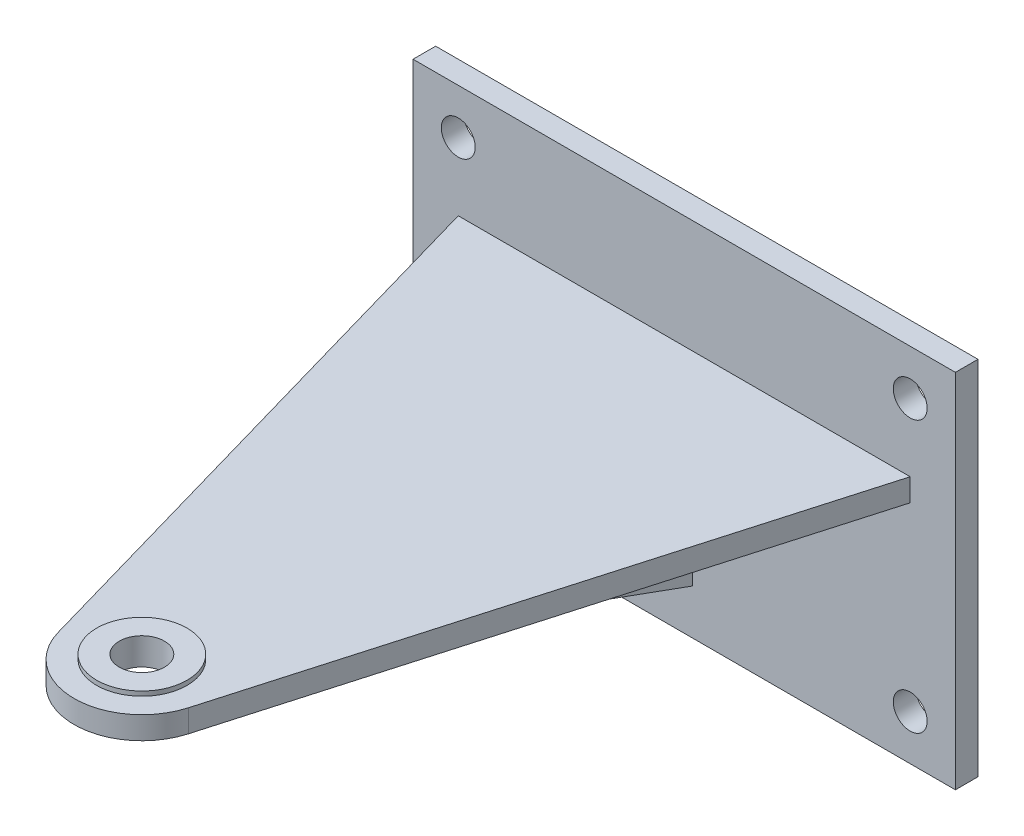
ISO-10303-21;
HEADER;
FILE_DESCRIPTION(('STEP AP214'),'2;1');
FILE_NAME('part.step','',(''),(''),'','','');
FILE_SCHEMA(('AUTOMOTIVE_DESIGN { 1 0 10303 214 1 1 1 1 }'));
ENDSEC;
DATA;
#1=APPLICATION_CONTEXT('core data for automotive mechanical design processes');
#2=APPLICATION_PROTOCOL_DEFINITION('international standard','automotive_design',2000,#1);
#3=PRODUCT_CONTEXT('',#1,'mechanical');
#4=PRODUCT('Part','Part','',(#3));
#5=PRODUCT_RELATED_PRODUCT_CATEGORY('part','',(#4));
#6=PRODUCT_DEFINITION_FORMATION('','',#4);
#7=PRODUCT_DEFINITION_CONTEXT('part definition',#1,'design');
#8=PRODUCT_DEFINITION('design','',#6,#7);
#9=PRODUCT_DEFINITION_SHAPE('','',#8);
#10=(LENGTH_UNIT() NAMED_UNIT(*) SI_UNIT(.MILLI.,.METRE.));
#11=(NAMED_UNIT(*) PLANE_ANGLE_UNIT() SI_UNIT($,.RADIAN.));
#12=(NAMED_UNIT(*) SI_UNIT($,.STERADIAN.) SOLID_ANGLE_UNIT());
#13=UNCERTAINTY_MEASURE_WITH_UNIT(LENGTH_MEASURE(1.E-05),#10,'distance_accuracy_value','');
#14=(GEOMETRIC_REPRESENTATION_CONTEXT(3) GLOBAL_UNCERTAINTY_ASSIGNED_CONTEXT((#13)) GLOBAL_UNIT_ASSIGNED_CONTEXT((#10,
#11,#12)) REPRESENTATION_CONTEXT('',''));
#15=CARTESIAN_POINT('',(0.,0.,0.));
#16=DIRECTION('',(0.,0.,1.));
#17=DIRECTION('',(1.,0.,0.));
#18=AXIS2_PLACEMENT_3D('',#15,#16,#17);
#19=CARTESIAN_POINT('',(0.,0.,6.35));
#20=DIRECTION('',(0.,0.,1.));
#21=DIRECTION('',(1.,0.,0.));
#22=AXIS2_PLACEMENT_3D('',#19,#20,#21);
#23=PLANE('',#22);
#24=CARTESIAN_POINT('',(-63.5,-38.1,6.35));
#25=DIRECTION('',(0.,0.,1.));
#26=DIRECTION('',(1.,0.,0.));
#27=AXIS2_PLACEMENT_3D('',#24,#25,#26);
#28=CIRCLE('',#27,4.7625);
#29=CARTESIAN_POINT('',(-58.7375,-38.1,6.35));
#30=VERTEX_POINT('',#29);
#31=EDGE_CURVE('E500',#30,#30,#28,.T.);
#32=ORIENTED_EDGE('',*,*,#31,.F.);
#33=EDGE_LOOP('',(#32));
#34=FACE_BOUND('',#33,.T.);
#35=CARTESIAN_POINT('',(63.5,38.1,6.35));
#36=DIRECTION('',(0.,0.,1.));
#37=DIRECTION('',(1.,0.,0.));
#38=AXIS2_PLACEMENT_3D('',#35,#36,#37);
#39=CIRCLE('',#38,4.7625);
#40=CARTESIAN_POINT('',(68.2625,38.1,6.35));
#41=VERTEX_POINT('',#40);
#42=EDGE_CURVE('E502',#41,#41,#39,.T.);
#43=ORIENTED_EDGE('',*,*,#42,.F.);
#44=EDGE_LOOP('',(#43));
#45=FACE_BOUND('',#44,.T.);
#46=CARTESIAN_POINT('',(63.5,-38.1,6.35));
#47=DIRECTION('',(0.,0.,1.));
#48=DIRECTION('',(1.,0.,0.));
#49=AXIS2_PLACEMENT_3D('',#46,#47,#48);
#50=CIRCLE('',#49,4.7625);
#51=CARTESIAN_POINT('',(68.2625,-38.1,6.35));
#52=VERTEX_POINT('',#51);
#53=EDGE_CURVE('E505',#52,#52,#50,.T.);
#54=ORIENTED_EDGE('',*,*,#53,.F.);
#55=EDGE_LOOP('',(#54));
#56=FACE_BOUND('',#55,.T.);
#57=CARTESIAN_POINT('',(-63.5,38.1,6.35));
#58=DIRECTION('',(0.,0.,1.));
#59=DIRECTION('',(1.,0.,0.));
#60=AXIS2_PLACEMENT_3D('',#57,#58,#59);
#61=CIRCLE('',#60,4.7625);
#62=CARTESIAN_POINT('',(-58.7375,38.1,6.35));
#63=VERTEX_POINT('',#62);
#64=EDGE_CURVE('E494',#63,#63,#61,.T.);
#65=ORIENTED_EDGE('',*,*,#64,.F.);
#66=EDGE_LOOP('',(#65));
#67=FACE_BOUND('',#66,.T.);
#68=DIRECTION('',(0.,1.,0.));
#69=VECTOR('',#68,1.);
#70=CARTESIAN_POINT('',(-63.5,12.7,6.35));
#71=LINE('',#70,#69);
#72=CARTESIAN_POINT('',(-63.5,12.7,6.35));
#73=VERTEX_POINT('',#72);
#74=CARTESIAN_POINT('',(-63.5,19.05,6.35));
#75=VERTEX_POINT('',#74);
#76=EDGE_CURVE('E239',#73,#75,#71,.T.);
#77=ORIENTED_EDGE('',*,*,#76,.T.);
#78=DIRECTION('',(-1.,0.,0.));
#79=VECTOR('',#78,1.);
#80=CARTESIAN_POINT('',(-63.5,19.05,6.35));
#81=LINE('',#80,#79);
#82=CARTESIAN_POINT('',(63.5,19.05,6.35));
#83=VERTEX_POINT('',#82);
#84=EDGE_CURVE('E223',#83,#75,#81,.T.);
#85=ORIENTED_EDGE('',*,*,#84,.F.);
#86=DIRECTION('',(0.,1.,0.));
#87=VECTOR('',#86,1.);
#88=CARTESIAN_POINT('',(63.5,12.7,6.34999999999998));
#89=LINE('',#88,#87);
#90=CARTESIAN_POINT('',(63.5,12.7,6.34999999999998));
#91=VERTEX_POINT('',#90);
#92=EDGE_CURVE('E249',#91,#83,#89,.T.);
#93=ORIENTED_EDGE('',*,*,#92,.F.);
#94=DIRECTION('',(-1.,0.,0.));
#95=VECTOR('',#94,1.);
#96=CARTESIAN_POINT('',(-63.5,12.7,6.35));
#97=LINE('',#96,#95);
#98=CARTESIAN_POINT('',(26.67,12.7,6.34999999999999));
#99=VERTEX_POINT('',#98);
#100=EDGE_CURVE('E224',#91,#99,#97,.T.);
#101=ORIENTED_EDGE('',*,*,#100,.T.);
#102=DIRECTION('',(0.,1.,0.));
#103=VECTOR('',#102,1.);
#104=CARTESIAN_POINT('',(26.67,0.,6.35));
#105=LINE('',#104,#103);
#106=CARTESIAN_POINT('',(26.67,-12.7,6.35));
#107=VERTEX_POINT('',#106);
#108=EDGE_CURVE('E191',#107,#99,#105,.T.);
#109=ORIENTED_EDGE('',*,*,#108,.F.);
#110=DIRECTION('',(1.,0.,0.));
#111=VECTOR('',#110,1.);
#112=CARTESIAN_POINT('',(0.,-12.7,6.35));
#113=LINE('',#112,#111);
#114=CARTESIAN_POINT('',(24.13,-12.7,6.35));
#115=VERTEX_POINT('',#114);
#116=EDGE_CURVE('E196',#115,#107,#113,.T.);
#117=ORIENTED_EDGE('',*,*,#116,.F.);
#118=DIRECTION('',(0.,1.,0.));
#119=VECTOR('',#118,1.);
#120=CARTESIAN_POINT('',(24.13,0.,6.35));
#121=LINE('',#120,#119);
#122=CARTESIAN_POINT('',(24.13,12.7,6.34999999999999));
#123=VERTEX_POINT('',#122);
#124=EDGE_CURVE('E185',#115,#123,#121,.T.);
#125=ORIENTED_EDGE('',*,*,#124,.T.);
#126=CARTESIAN_POINT('',(2.38125,12.7,6.34999999999999));
#127=VERTEX_POINT('',#126);
#128=EDGE_CURVE('E228',#123,#127,#97,.T.);
#129=ORIENTED_EDGE('',*,*,#128,.T.);
#130=DIRECTION('',(0.,1.,0.));
#131=VECTOR('',#130,1.);
#132=CARTESIAN_POINT('',(2.38125,12.7,6.34999999999998));
#133=LINE('',#132,#131);
#134=CARTESIAN_POINT('',(2.38125,-38.1,6.35));
#135=VERTEX_POINT('',#134);
#136=EDGE_CURVE('E199',#135,#127,#133,.T.);
#137=ORIENTED_EDGE('',*,*,#136,.F.);
#138=DIRECTION('',(-1.,0.,0.));
#139=VECTOR('',#138,1.);
#140=CARTESIAN_POINT('',(2.38125,-38.1,6.35));
#141=LINE('',#140,#139);
#142=CARTESIAN_POINT('',(-2.38125,-38.1,6.35));
#143=VERTEX_POINT('',#142);
#144=EDGE_CURVE('E209',#135,#143,#141,.T.);
#145=ORIENTED_EDGE('',*,*,#144,.T.);
#146=DIRECTION('',(0.,1.,0.));
#147=VECTOR('',#146,1.);
#148=CARTESIAN_POINT('',(-2.38125,12.7,6.34999999999998));
#149=LINE('',#148,#147);
#150=CARTESIAN_POINT('',(-2.38125,12.7,6.34999999999998));
#151=VERTEX_POINT('',#150);
#152=EDGE_CURVE('E198',#143,#151,#149,.T.);
#153=ORIENTED_EDGE('',*,*,#152,.T.);
#154=CARTESIAN_POINT('',(-24.13,12.7,6.34999999999999));
#155=VERTEX_POINT('',#154);
#156=EDGE_CURVE('E230',#151,#155,#97,.T.);
#157=ORIENTED_EDGE('',*,*,#156,.T.);
#158=DIRECTION('',(0.,-1.,0.));
#159=VECTOR('',#158,1.);
#160=CARTESIAN_POINT('',(-24.13,0.,6.35));
#161=LINE('',#160,#159);
#162=CARTESIAN_POINT('',(-24.13,-12.7,6.35));
#163=VERTEX_POINT('',#162);
#164=EDGE_CURVE('E50',#155,#163,#161,.T.);
#165=ORIENTED_EDGE('',*,*,#164,.T.);
#166=DIRECTION('',(-1.,0.,0.));
#167=VECTOR('',#166,1.);
#168=CARTESIAN_POINT('',(0.,-12.7,6.35));
#169=LINE('',#168,#167);
#170=CARTESIAN_POINT('',(-26.67,-12.7,6.35));
#171=VERTEX_POINT('',#170);
#172=EDGE_CURVE('E167',#171,#163,#169,.F.);
#173=ORIENTED_EDGE('',*,*,#172,.F.);
#174=DIRECTION('',(0.,-1.,0.));
#175=VECTOR('',#174,1.);
#176=CARTESIAN_POINT('',(-26.67,0.,6.35));
#177=LINE('',#176,#175);
#178=CARTESIAN_POINT('',(-26.67,12.7,6.34999999999999));
#179=VERTEX_POINT('',#178);
#180=EDGE_CURVE('E174',#179,#171,#177,.T.);
#181=ORIENTED_EDGE('',*,*,#180,.F.);
#182=EDGE_CURVE('E229',#179,#73,#97,.T.);
#183=ORIENTED_EDGE('',*,*,#182,.T.);
#184=EDGE_LOOP('',(#77,#85,#93,#101,#109,#117,#125,#129,#137,#145,#153,#157,#165,#173,#181,#183));
#185=FACE_BOUND('',#184,.T.);
#186=DIRECTION('',(-1.,0.,0.));
#187=VECTOR('',#186,1.);
#188=CARTESIAN_POINT('',(76.2,50.8,6.35));
#189=LINE('',#188,#187);
#190=CARTESIAN_POINT('',(76.2,50.8,6.35));
#191=VERTEX_POINT('',#190);
#192=CARTESIAN_POINT('',(-76.2,50.8,6.35));
#193=VERTEX_POINT('',#192);
#194=EDGE_CURVE('E267',#191,#193,#189,.T.);
#195=ORIENTED_EDGE('',*,*,#194,.T.);
#196=DIRECTION('',(0.,-1.,0.));
#197=VECTOR('',#196,1.);
#198=CARTESIAN_POINT('',(-76.2,-50.8,6.35));
#199=LINE('',#198,#197);
#200=CARTESIAN_POINT('',(-76.2,-50.8,6.35));
#201=VERTEX_POINT('',#200);
#202=EDGE_CURVE('E259',#193,#201,#199,.T.);
#203=ORIENTED_EDGE('',*,*,#202,.T.);
#204=DIRECTION('',(1.,0.,0.));
#205=VECTOR('',#204,1.);
#206=CARTESIAN_POINT('',(76.2,-50.8,6.35));
#207=LINE('',#206,#205);
#208=CARTESIAN_POINT('',(76.2,-50.8,6.35));
#209=VERTEX_POINT('',#208);
#210=EDGE_CURVE('E262',#201,#209,#207,.T.);
#211=ORIENTED_EDGE('',*,*,#210,.T.);
#212=DIRECTION('',(0.,1.,0.));
#213=VECTOR('',#212,1.);
#214=CARTESIAN_POINT('',(76.2,-50.8,6.35));
#215=LINE('',#214,#213);
#216=EDGE_CURVE('E265',#209,#191,#215,.T.);
#217=ORIENTED_EDGE('',*,*,#216,.T.);
#218=EDGE_LOOP('',(#195,#203,#211,#217));
#219=FACE_BOUND('',#218,.T.);
#220=ADVANCED_FACE('F35',(#34,#45,#56,#67,#185,#219),#23,.T.);
#221=CARTESIAN_POINT('',(0.,12.7,158.75));
#222=DIRECTION('',(0.,-1.,0.));
#223=DIRECTION('',(1.,0.,0.));
#224=AXIS2_PLACEMENT_3D('',#221,#222,#223);
#225=PLANE('',#224);
#226=CARTESIAN_POINT('',(0.,12.7,158.75));
#227=DIRECTION('',(0.,-1.,0.));
#228=DIRECTION('',(1.,0.,0.));
#229=AXIS2_PLACEMENT_3D('',#226,#227,#228);
#230=CIRCLE('',#229,6.35);
#231=CARTESIAN_POINT('',(6.35000000000002,12.7,158.75));
#232=VERTEX_POINT('',#231);
#233=EDGE_CURVE('E168',#232,#232,#230,.T.);
#234=ORIENTED_EDGE('',*,*,#233,.F.);
#235=EDGE_LOOP('',(#234));
#236=FACE_BOUND('',#235,.T.);
#237=DIRECTION('',(0.,0.,-1.));
#238=VECTOR('',#237,1.);
#239=CARTESIAN_POINT('',(-26.67,12.7,158.75));
#240=LINE('',#239,#238);
#241=CARTESIAN_POINT('',(-26.67,12.7,57.15));
#242=VERTEX_POINT('',#241);
#243=EDGE_CURVE('E173',#242,#179,#240,.T.);
#244=ORIENTED_EDGE('',*,*,#243,.F.);
#245=DIRECTION('',(1.,0.,0.));
#246=VECTOR('',#245,1.);
#247=CARTESIAN_POINT('',(0.,12.7,57.15));
#248=LINE('',#247,#246);
#249=CARTESIAN_POINT('',(-24.13,12.7,57.15));
#250=VERTEX_POINT('',#249);
#251=EDGE_CURVE('E164',#250,#242,#248,.F.);
#252=ORIENTED_EDGE('',*,*,#251,.F.);
#253=DIRECTION('',(0.,0.,-1.));
#254=VECTOR('',#253,1.);
#255=CARTESIAN_POINT('',(-24.13,12.7,158.75));
#256=LINE('',#255,#254);
#257=EDGE_CURVE('E152',#250,#155,#256,.T.);
#258=ORIENTED_EDGE('',*,*,#257,.T.);
#259=ORIENTED_EDGE('',*,*,#156,.F.);
#260=DIRECTION('',(0.,0.,1.));
#261=VECTOR('',#260,1.);
#262=CARTESIAN_POINT('',(-2.38125,12.7,6.34999999999998));
#263=LINE('',#262,#261);
#264=CARTESIAN_POINT('',(-2.38125,12.7,146.05));
#265=VERTEX_POINT('',#264);
#266=EDGE_CURVE('E212',#151,#265,#263,.T.);
#267=ORIENTED_EDGE('',*,*,#266,.T.);
#268=DIRECTION('',(-1.,0.,0.));
#269=VECTOR('',#268,1.);
#270=CARTESIAN_POINT('',(2.38125,12.7,146.05));
#271=LINE('',#270,#269);
#272=CARTESIAN_POINT('',(2.38125,12.7,146.05));
#273=VERTEX_POINT('',#272);
#274=EDGE_CURVE('E217',#273,#265,#271,.T.);
#275=ORIENTED_EDGE('',*,*,#274,.F.);
#276=DIRECTION('',(0.,0.,1.));
#277=VECTOR('',#276,1.);
#278=CARTESIAN_POINT('',(2.38125,12.7,6.34999999999998));
#279=LINE('',#278,#277);
#280=EDGE_CURVE('E202',#127,#273,#279,.T.);
#281=ORIENTED_EDGE('',*,*,#280,.F.);
#282=ORIENTED_EDGE('',*,*,#128,.F.);
#283=DIRECTION('',(0.,0.,1.));
#284=VECTOR('',#283,1.);
#285=CARTESIAN_POINT('',(24.13,12.7,158.75));
#286=LINE('',#285,#284);
#287=CARTESIAN_POINT('',(24.13,12.7,57.15));
#288=VERTEX_POINT('',#287);
#289=EDGE_CURVE('E183',#123,#288,#286,.T.);
#290=ORIENTED_EDGE('',*,*,#289,.T.);
#291=DIRECTION('',(-1.,0.,0.));
#292=VECTOR('',#291,1.);
#293=CARTESIAN_POINT('',(0.,12.7,57.15));
#294=LINE('',#293,#292);
#295=CARTESIAN_POINT('',(26.67,12.7,57.15));
#296=VERTEX_POINT('',#295);
#297=EDGE_CURVE('E193',#296,#288,#294,.T.);
#298=ORIENTED_EDGE('',*,*,#297,.F.);
#299=DIRECTION('',(0.,0.,1.));
#300=VECTOR('',#299,1.);
#301=CARTESIAN_POINT('',(26.67,12.7,158.75));
#302=LINE('',#301,#300);
#303=EDGE_CURVE('E188',#99,#296,#302,.T.);
#304=ORIENTED_EDGE('',*,*,#303,.F.);
#305=ORIENTED_EDGE('',*,*,#100,.F.);
#306=DIRECTION('',(0.27553762041849,0.,-0.961290289004376));
#307=VECTOR('',#306,1.);
#308=CARTESIAN_POINT('',(63.5,12.7,6.34999999999998));
#309=LINE('',#308,#307);
#310=CARTESIAN_POINT('',(18.3125800055333,12.7,163.998991668972));
#311=VERTEX_POINT('',#310);
#312=EDGE_CURVE('E236',#311,#91,#309,.T.);
#313=ORIENTED_EDGE('',*,*,#312,.F.);
#314=CARTESIAN_POINT('',(0.,12.7,158.75));
#315=DIRECTION('',(0.,1.,0.));
#316=DIRECTION('',(1.,0.,0.));
#317=AXIS2_PLACEMENT_3D('',#314,#315,#316);
#318=CIRCLE('',#317,19.05);
#319=CARTESIAN_POINT('',(-18.3125800055333,12.7,163.998991668972));
#320=VERTEX_POINT('',#319);
#321=EDGE_CURVE('E233',#320,#311,#318,.T.);
#322=ORIENTED_EDGE('',*,*,#321,.F.);
#323=DIRECTION('',(0.27553762041849,0.,0.961290289004376));
#324=VECTOR('',#323,1.);
#325=CARTESIAN_POINT('',(-63.5,12.7,6.35));
#326=LINE('',#325,#324);
#327=EDGE_CURVE('E227',#73,#320,#326,.T.);
#328=ORIENTED_EDGE('',*,*,#327,.F.);
#329=ORIENTED_EDGE('',*,*,#182,.F.);
#330=EDGE_LOOP('',(#244,#252,#258,#259,#267,#275,#281,#282,#290,#298,#304,#305,#313,#322,#328,#329));
#331=FACE_BOUND('',#330,.T.);
#332=ADVANCED_FACE('F171',(#236,#331),#225,.T.);
#333=CARTESIAN_POINT('',(-76.2,-50.8,6.35));
#334=DIRECTION('',(1.,0.,0.));
#335=DIRECTION('',(0.,0.,-1.));
#336=AXIS2_PLACEMENT_3D('',#333,#334,#335);
#337=PLANE('',#336);
#338=DIRECTION('',(0.,-1.,0.));
#339=VECTOR('',#338,1.);
#340=CARTESIAN_POINT('',(-76.2,-50.8,0.));
#341=LINE('',#340,#339);
#342=CARTESIAN_POINT('',(-76.2,50.8,0.));
#343=VERTEX_POINT('',#342);
#344=CARTESIAN_POINT('',(-76.2,-50.8,0.));
#345=VERTEX_POINT('',#344);
#346=EDGE_CURVE('E252',#343,#345,#341,.T.);
#347=ORIENTED_EDGE('',*,*,#346,.T.);
#348=DIRECTION('',(0.,0.,-1.));
#349=VECTOR('',#348,1.);
#350=CARTESIAN_POINT('',(-76.2,-50.8,6.35));
#351=LINE('',#350,#349);
#352=EDGE_CURVE('E43',#201,#345,#351,.T.);
#353=ORIENTED_EDGE('',*,*,#352,.F.);
#354=ORIENTED_EDGE('',*,*,#202,.F.);
#355=DIRECTION('',(0.,0.,-1.));
#356=VECTOR('',#355,1.);
#357=CARTESIAN_POINT('',(-76.2,50.8,6.35));
#358=LINE('',#357,#356);
#359=EDGE_CURVE('E269',#193,#343,#358,.T.);
#360=ORIENTED_EDGE('',*,*,#359,.T.);
#361=EDGE_LOOP('',(#347,#353,#354,#360));
#362=FACE_BOUND('',#361,.T.);
#363=ADVANCED_FACE('F37',(#362),#337,.F.);
#364=CARTESIAN_POINT('',(76.2,-50.8,6.35));
#365=DIRECTION('',(0.,1.,0.));
#366=DIRECTION('',(-1.,0.,0.));
#367=AXIS2_PLACEMENT_3D('',#364,#365,#366);
#368=PLANE('',#367);
#369=DIRECTION('',(1.,0.,0.));
#370=VECTOR('',#369,1.);
#371=CARTESIAN_POINT('',(76.2,-50.8,0.));
#372=LINE('',#371,#370);
#373=CARTESIAN_POINT('',(76.2,-50.8,0.));
#374=VERTEX_POINT('',#373);
#375=EDGE_CURVE('E272',#345,#374,#372,.T.);
#376=ORIENTED_EDGE('',*,*,#375,.T.);
#377=DIRECTION('',(0.,0.,-1.));
#378=VECTOR('',#377,1.);
#379=CARTESIAN_POINT('',(76.2,-50.8,6.35));
#380=LINE('',#379,#378);
#381=EDGE_CURVE('E282',#209,#374,#380,.T.);
#382=ORIENTED_EDGE('',*,*,#381,.F.);
#383=ORIENTED_EDGE('',*,*,#210,.F.);
#384=ORIENTED_EDGE('',*,*,#352,.T.);
#385=EDGE_LOOP('',(#376,#382,#383,#384));
#386=FACE_BOUND('',#385,.T.);
#387=ADVANCED_FACE('F287',(#386),#368,.F.);
#388=CARTESIAN_POINT('',(76.2,-50.8,6.35));
#389=DIRECTION('',(-1.,0.,0.));
#390=DIRECTION('',(0.,0.,1.));
#391=AXIS2_PLACEMENT_3D('',#388,#389,#390);
#392=PLANE('',#391);
#393=DIRECTION('',(0.,1.,0.));
#394=VECTOR('',#393,1.);
#395=CARTESIAN_POINT('',(76.2,-50.8,0.));
#396=LINE('',#395,#394);
#397=CARTESIAN_POINT('',(76.2,50.8,0.));
#398=VERTEX_POINT('',#397);
#399=EDGE_CURVE('E274',#374,#398,#396,.T.);
#400=ORIENTED_EDGE('',*,*,#399,.T.);
#401=DIRECTION('',(0.,0.,-1.));
#402=VECTOR('',#401,1.);
#403=CARTESIAN_POINT('',(76.2,50.8,6.35));
#404=LINE('',#403,#402);
#405=EDGE_CURVE('E279',#191,#398,#404,.T.);
#406=ORIENTED_EDGE('',*,*,#405,.F.);
#407=ORIENTED_EDGE('',*,*,#216,.F.);
#408=ORIENTED_EDGE('',*,*,#381,.T.);
#409=EDGE_LOOP('',(#400,#406,#407,#408));
#410=FACE_BOUND('',#409,.T.);
#411=ADVANCED_FACE('F299',(#410),#392,.F.);
#412=CARTESIAN_POINT('',(76.2,50.8,6.35));
#413=DIRECTION('',(0.,-1.,0.));
#414=DIRECTION('',(1.,0.,0.));
#415=AXIS2_PLACEMENT_3D('',#412,#413,#414);
#416=PLANE('',#415);
#417=ORIENTED_EDGE('',*,*,#359,.F.);
#418=ORIENTED_EDGE('',*,*,#194,.F.);
#419=ORIENTED_EDGE('',*,*,#405,.T.);
#420=DIRECTION('',(-1.,0.,0.));
#421=VECTOR('',#420,1.);
#422=CARTESIAN_POINT('',(76.2,50.8,0.));
#423=LINE('',#422,#421);
#424=EDGE_CURVE('E263',#398,#343,#423,.T.);
#425=ORIENTED_EDGE('',*,*,#424,.T.);
#426=EDGE_LOOP('',(#417,#418,#419,#425));
#427=FACE_BOUND('',#426,.T.);
#428=ADVANCED_FACE('F303',(#427),#416,.F.);
#429=CARTESIAN_POINT('',(0.,0.,0.));
#430=DIRECTION('',(0.,0.,1.));
#431=DIRECTION('',(1.,0.,0.));
#432=AXIS2_PLACEMENT_3D('',#429,#430,#431);
#433=PLANE('',#432);
#434=CARTESIAN_POINT('',(-63.5,-38.1,0.));
#435=DIRECTION('',(0.,0.,1.));
#436=DIRECTION('',(1.,0.,0.));
#437=AXIS2_PLACEMENT_3D('',#434,#435,#436);
#438=CIRCLE('',#437,4.7625);
#439=CARTESIAN_POINT('',(-58.7375,-38.1,0.));
#440=VERTEX_POINT('',#439);
#441=EDGE_CURVE('E508',#440,#440,#438,.T.);
#442=ORIENTED_EDGE('',*,*,#441,.T.);
#443=EDGE_LOOP('',(#442));
#444=FACE_BOUND('',#443,.T.);
#445=CARTESIAN_POINT('',(63.5,38.1,0.));
#446=DIRECTION('',(0.,0.,1.));
#447=DIRECTION('',(1.,0.,0.));
#448=AXIS2_PLACEMENT_3D('',#445,#446,#447);
#449=CIRCLE('',#448,4.7625);
#450=CARTESIAN_POINT('',(68.2625,38.1,0.));
#451=VERTEX_POINT('',#450);
#452=EDGE_CURVE('E512',#451,#451,#449,.T.);
#453=ORIENTED_EDGE('',*,*,#452,.T.);
#454=EDGE_LOOP('',(#453));
#455=FACE_BOUND('',#454,.T.);
#456=CARTESIAN_POINT('',(63.5,-38.1,0.));
#457=DIRECTION('',(0.,0.,1.));
#458=DIRECTION('',(1.,0.,0.));
#459=AXIS2_PLACEMENT_3D('',#456,#457,#458);
#460=CIRCLE('',#459,4.7625);
#461=CARTESIAN_POINT('',(68.2625,-38.1,0.));
#462=VERTEX_POINT('',#461);
#463=EDGE_CURVE('E509',#462,#462,#460,.T.);
#464=ORIENTED_EDGE('',*,*,#463,.T.);
#465=EDGE_LOOP('',(#464));
#466=FACE_BOUND('',#465,.T.);
#467=CARTESIAN_POINT('',(-63.5,38.1,0.));
#468=DIRECTION('',(0.,0.,1.));
#469=DIRECTION('',(1.,0.,0.));
#470=AXIS2_PLACEMENT_3D('',#467,#468,#469);
#471=CIRCLE('',#470,4.7625);
#472=CARTESIAN_POINT('',(-58.7375,38.1,0.));
#473=VERTEX_POINT('',#472);
#474=EDGE_CURVE('E497',#473,#473,#471,.T.);
#475=ORIENTED_EDGE('',*,*,#474,.T.);
#476=EDGE_LOOP('',(#475));
#477=FACE_BOUND('',#476,.T.);
#478=ORIENTED_EDGE('',*,*,#346,.F.);
#479=ORIENTED_EDGE('',*,*,#424,.F.);
#480=ORIENTED_EDGE('',*,*,#399,.F.);
#481=ORIENTED_EDGE('',*,*,#375,.F.);
#482=EDGE_LOOP('',(#478,#479,#480,#481));
#483=FACE_BOUND('',#482,.T.);
#484=ADVANCED_FACE('F295',(#444,#455,#466,#477,#483),#433,.F.);
#485=CARTESIAN_POINT('',(63.5,12.7,6.34999999999998));
#486=DIRECTION('',(0.961290289004376,0.,0.27553762041849));
#487=DIRECTION('',(0.27553762041849,0.,-0.961290289004376));
#488=AXIS2_PLACEMENT_3D('',#485,#486,#487);
#489=PLANE('',#488);
#490=DIRECTION('',(0.27553762041849,0.,-0.961290289004376));
#491=VECTOR('',#490,1.);
#492=CARTESIAN_POINT('',(63.5,19.05,6.34999999999998));
#493=LINE('',#492,#491);
#494=CARTESIAN_POINT('',(18.3125800055333,19.05,163.998991668972));
#495=VERTEX_POINT('',#494);
#496=EDGE_CURVE('E247',#495,#83,#493,.T.);
#497=ORIENTED_EDGE('',*,*,#496,.F.);
#498=DIRECTION('',(0.,1.,0.));
#499=VECTOR('',#498,1.);
#500=CARTESIAN_POINT('',(18.3125800055333,12.7,163.998991668972));
#501=LINE('',#500,#499);
#502=EDGE_CURVE('E253',#311,#495,#501,.T.);
#503=ORIENTED_EDGE('',*,*,#502,.F.);
#504=ORIENTED_EDGE('',*,*,#312,.T.);
#505=ORIENTED_EDGE('',*,*,#92,.T.);
#506=EDGE_LOOP('',(#497,#503,#504,#505));
#507=FACE_BOUND('',#506,.T.);
#508=ADVANCED_FACE('F321',(#507),#489,.T.);
#509=CARTESIAN_POINT('',(0.,12.7,158.75));
#510=DIRECTION('',(0.,1.,0.));
#511=DIRECTION('',(-1.,0.,0.));
#512=AXIS2_PLACEMENT_3D('',#509,#510,#511);
#513=CYLINDRICAL_SURFACE('',#512,19.05);
#514=CARTESIAN_POINT('',(0.,19.05,158.75));
#515=DIRECTION('',(0.,1.,0.));
#516=DIRECTION('',(1.,0.,0.));
#517=AXIS2_PLACEMENT_3D('',#514,#515,#516);
#518=CIRCLE('',#517,19.05);
#519=CARTESIAN_POINT('',(-18.3125800055333,19.05,163.998991668972));
#520=VERTEX_POINT('',#519);
#521=EDGE_CURVE('E244',#520,#495,#518,.T.);
#522=ORIENTED_EDGE('',*,*,#521,.F.);
#523=DIRECTION('',(0.,1.,0.));
#524=VECTOR('',#523,1.);
#525=CARTESIAN_POINT('',(-18.3125800055333,12.7,163.998991668972));
#526=LINE('',#525,#524);
#527=EDGE_CURVE('E255',#320,#520,#526,.T.);
#528=ORIENTED_EDGE('',*,*,#527,.F.);
#529=ORIENTED_EDGE('',*,*,#321,.T.);
#530=ORIENTED_EDGE('',*,*,#502,.T.);
#531=EDGE_LOOP('',(#522,#528,#529,#530));
#532=FACE_BOUND('',#531,.T.);
#533=ADVANCED_FACE('F459',(#532),#513,.T.);
#534=CARTESIAN_POINT('',(-63.5,12.7,6.35));
#535=DIRECTION('',(-0.961290289004376,0.,0.27553762041849));
#536=DIRECTION('',(0.27553762041849,0.,0.961290289004376));
#537=AXIS2_PLACEMENT_3D('',#534,#535,#536);
#538=PLANE('',#537);
#539=DIRECTION('',(0.27553762041849,0.,0.961290289004376));
#540=VECTOR('',#539,1.);
#541=CARTESIAN_POINT('',(-63.5,19.05,6.35));
#542=LINE('',#541,#540);
#543=EDGE_CURVE('E241',#75,#520,#542,.T.);
#544=ORIENTED_EDGE('',*,*,#543,.F.);
#545=ORIENTED_EDGE('',*,*,#76,.F.);
#546=ORIENTED_EDGE('',*,*,#327,.T.);
#547=ORIENTED_EDGE('',*,*,#527,.T.);
#548=EDGE_LOOP('',(#544,#545,#546,#547));
#549=FACE_BOUND('',#548,.T.);
#550=ADVANCED_FACE('F317',(#549),#538,.T.);
#551=CARTESIAN_POINT('',(0.,19.05,158.75));
#552=DIRECTION('',(0.,-1.,0.));
#553=DIRECTION('',(1.,0.,0.));
#554=AXIS2_PLACEMENT_3D('',#551,#552,#553);
#555=PLANE('',#554);
#556=ORIENTED_EDGE('',*,*,#84,.T.);
#557=ORIENTED_EDGE('',*,*,#543,.T.);
#558=ORIENTED_EDGE('',*,*,#521,.T.);
#559=ORIENTED_EDGE('',*,*,#496,.T.);
#560=EDGE_LOOP('',(#556,#557,#558,#559));
#561=FACE_BOUND('',#560,.T.);
#562=CARTESIAN_POINT('',(0.,19.05,158.75));
#563=DIRECTION('',(0.,-1.,0.));
#564=DIRECTION('',(1.,0.,0.));
#565=AXIS2_PLACEMENT_3D('',#562,#563,#564);
#566=CIRCLE('',#565,12.7);
#567=CARTESIAN_POINT('',(12.7,19.05,158.75));
#568=VERTEX_POINT('',#567);
#569=EDGE_CURVE('E11',#568,#568,#566,.F.);
#570=ORIENTED_EDGE('',*,*,#569,.F.);
#571=EDGE_LOOP('',(#570));
#572=FACE_BOUND('',#571,.T.);
#573=ADVANCED_FACE('F453',(#561,#572),#555,.F.);
#574=CARTESIAN_POINT('',(0.,20.32,158.75));
#575=DIRECTION('',(0.,-1.,0.));
#576=DIRECTION('',(1.,0.,0.));
#577=AXIS2_PLACEMENT_3D('',#574,#575,#576);
#578=CYLINDRICAL_SURFACE('',#577,12.7);
#579=CARTESIAN_POINT('',(0.,20.32,158.75));
#580=DIRECTION('',(0.,1.,0.));
#581=DIRECTION('',(-1.,0.,0.));
#582=AXIS2_PLACEMENT_3D('',#579,#580,#581);
#583=CIRCLE('',#582,12.7);
#584=CARTESIAN_POINT('',(-12.7,20.32,158.75));
#585=VERTEX_POINT('',#584);
#586=EDGE_CURVE('E220',#585,#585,#583,.T.);
#587=ORIENTED_EDGE('',*,*,#586,.F.);
#588=EDGE_LOOP('',(#587));
#589=FACE_BOUND('',#588,.T.);
#590=ORIENTED_EDGE('',*,*,#569,.T.);
#591=EDGE_LOOP('',(#590));
#592=FACE_BOUND('',#591,.T.);
#593=ADVANCED_FACE('F353',(#589,#592),#578,.T.);
#594=CARTESIAN_POINT('',(0.,20.32,158.75));
#595=DIRECTION('',(0.,1.,0.));
#596=DIRECTION('',(-1.,0.,0.));
#597=AXIS2_PLACEMENT_3D('',#594,#595,#596);
#598=PLANE('',#597);
#599=CARTESIAN_POINT('',(0.,20.32,158.75));
#600=DIRECTION('',(0.,1.,0.));
#601=DIRECTION('',(-1.,0.,0.));
#602=AXIS2_PLACEMENT_3D('',#599,#600,#601);
#603=CIRCLE('',#602,6.35);
#604=CARTESIAN_POINT('',(-6.34999999999998,20.32,158.75));
#605=VERTEX_POINT('',#604);
#606=EDGE_CURVE('E491',#605,#605,#603,.T.);
#607=ORIENTED_EDGE('',*,*,#606,.F.);
#608=EDGE_LOOP('',(#607));
#609=FACE_BOUND('',#608,.T.);
#610=ORIENTED_EDGE('',*,*,#586,.T.);
#611=EDGE_LOOP('',(#610));
#612=FACE_BOUND('',#611,.T.);
#613=ADVANCED_FACE('F348',(#609,#612),#598,.T.);
#614=CARTESIAN_POINT('',(2.38125,-38.1,6.35));
#615=DIRECTION('',(0.,0.939793423488437,-0.341743063086704));
#616=DIRECTION('',(0.,0.341743063086704,0.939793423488437));
#617=AXIS2_PLACEMENT_3D('',#614,#615,#616);
#618=PLANE('',#617);
#619=DIRECTION('',(0.,-0.341743063086704,-0.939793423488437));
#620=VECTOR('',#619,1.);
#621=CARTESIAN_POINT('',(-2.38125,-38.1,6.35));
#622=LINE('',#621,#620);
#623=EDGE_CURVE('E203',#265,#143,#622,.T.);
#624=ORIENTED_EDGE('',*,*,#623,.T.);
#625=ORIENTED_EDGE('',*,*,#144,.F.);
#626=DIRECTION('',(0.,-0.341743063086704,-0.939793423488437));
#627=VECTOR('',#626,1.);
#628=CARTESIAN_POINT('',(2.38125,-38.1,6.35));
#629=LINE('',#628,#627);
#630=EDGE_CURVE('E206',#273,#135,#629,.T.);
#631=ORIENTED_EDGE('',*,*,#630,.F.);
#632=ORIENTED_EDGE('',*,*,#274,.T.);
#633=EDGE_LOOP('',(#624,#625,#631,#632));
#634=FACE_BOUND('',#633,.T.);
#635=ADVANCED_FACE('F352',(#634),#618,.F.);
#636=CARTESIAN_POINT('',(2.38125,0.,0.));
#637=DIRECTION('',(-1.,0.,0.));
#638=DIRECTION('',(0.,0.,1.));
#639=AXIS2_PLACEMENT_3D('',#636,#637,#638);
#640=PLANE('',#639);
#641=ORIENTED_EDGE('',*,*,#136,.T.);
#642=ORIENTED_EDGE('',*,*,#280,.T.);
#643=ORIENTED_EDGE('',*,*,#630,.T.);
#644=EDGE_LOOP('',(#641,#642,#643));
#645=FACE_BOUND('',#644,.T.);
#646=ADVANCED_FACE('F444',(#645),#640,.F.);
#647=CARTESIAN_POINT('',(-2.38125,0.,0.));
#648=DIRECTION('',(-1.,0.,0.));
#649=DIRECTION('',(0.,0.,1.));
#650=AXIS2_PLACEMENT_3D('',#647,#648,#649);
#651=PLANE('',#650);
#652=ORIENTED_EDGE('',*,*,#152,.F.);
#653=ORIENTED_EDGE('',*,*,#623,.F.);
#654=ORIENTED_EDGE('',*,*,#266,.F.);
#655=EDGE_LOOP('',(#652,#653,#654));
#656=FACE_BOUND('',#655,.T.);
#657=ADVANCED_FACE('F442',(#656),#651,.T.);
#658=CARTESIAN_POINT('',(25.4,12.7,57.15));
#659=DIRECTION('',(0.,-0.894427190999916,0.447213595499958));
#660=DIRECTION('',(0.,-0.447213595499958,-0.894427190999916));
#661=AXIS2_PLACEMENT_3D('',#658,#659,#660);
#662=PLANE('',#661);
#663=DIRECTION('',(0.,-0.447213595499958,-0.894427190999916));
#664=VECTOR('',#663,1.);
#665=CARTESIAN_POINT('',(24.13,12.7,57.15));
#666=LINE('',#665,#664);
#667=EDGE_CURVE('E58',#288,#115,#666,.T.);
#668=ORIENTED_EDGE('',*,*,#667,.T.);
#669=ORIENTED_EDGE('',*,*,#116,.T.);
#670=DIRECTION('',(0.,-0.447213595499958,-0.894427190999916));
#671=VECTOR('',#670,1.);
#672=CARTESIAN_POINT('',(26.67,12.7,57.15));
#673=LINE('',#672,#671);
#674=EDGE_CURVE('E180',#296,#107,#673,.T.);
#675=ORIENTED_EDGE('',*,*,#674,.F.);
#676=ORIENTED_EDGE('',*,*,#297,.T.);
#677=EDGE_LOOP('',(#668,#669,#675,#676));
#678=FACE_BOUND('',#677,.T.);
#679=ADVANCED_FACE('F436',(#678),#662,.T.);
#680=CARTESIAN_POINT('',(26.67,0.,88.9));
#681=DIRECTION('',(1.,0.,0.));
#682=DIRECTION('',(0.,0.,-1.));
#683=AXIS2_PLACEMENT_3D('',#680,#681,#682);
#684=PLANE('',#683);
#685=ORIENTED_EDGE('',*,*,#674,.T.);
#686=ORIENTED_EDGE('',*,*,#108,.T.);
#687=ORIENTED_EDGE('',*,*,#303,.T.);
#688=EDGE_LOOP('',(#685,#686,#687));
#689=FACE_BOUND('',#688,.T.);
#690=ADVANCED_FACE('F433',(#689),#684,.T.);
#691=CARTESIAN_POINT('',(24.13,0.,88.9));
#692=DIRECTION('',(1.,0.,0.));
#693=DIRECTION('',(0.,0.,-1.));
#694=AXIS2_PLACEMENT_3D('',#691,#692,#693);
#695=PLANE('',#694);
#696=ORIENTED_EDGE('',*,*,#124,.F.);
#697=ORIENTED_EDGE('',*,*,#667,.F.);
#698=ORIENTED_EDGE('',*,*,#289,.F.);
#699=EDGE_LOOP('',(#696,#697,#698));
#700=FACE_BOUND('',#699,.T.);
#701=ADVANCED_FACE('F432',(#700),#695,.F.);
#702=CARTESIAN_POINT('',(-25.4,12.7,57.15));
#703=DIRECTION('',(0.,0.894427190999916,-0.447213595499958));
#704=DIRECTION('',(0.,-0.447213595499958,-0.894427190999916));
#705=AXIS2_PLACEMENT_3D('',#702,#703,#704);
#706=PLANE('',#705);
#707=DIRECTION('',(0.,-0.447213595499958,-0.894427190999916));
#708=VECTOR('',#707,1.);
#709=CARTESIAN_POINT('',(-26.67,12.7,57.15));
#710=LINE('',#709,#708);
#711=EDGE_CURVE('E159',#242,#171,#710,.T.);
#712=ORIENTED_EDGE('',*,*,#711,.T.);
#713=ORIENTED_EDGE('',*,*,#172,.T.);
#714=DIRECTION('',(0.,-0.447213595499958,-0.894427190999916));
#715=VECTOR('',#714,1.);
#716=CARTESIAN_POINT('',(-24.13,12.7,57.15));
#717=LINE('',#716,#715);
#718=EDGE_CURVE('E155',#250,#163,#717,.T.);
#719=ORIENTED_EDGE('',*,*,#718,.F.);
#720=ORIENTED_EDGE('',*,*,#251,.T.);
#721=EDGE_LOOP('',(#712,#713,#719,#720));
#722=FACE_BOUND('',#721,.T.);
#723=ADVANCED_FACE('F163',(#722),#706,.F.);
#724=CARTESIAN_POINT('',(-26.67,0.,88.9));
#725=DIRECTION('',(-1.,0.,0.));
#726=DIRECTION('',(0.,0.,1.));
#727=AXIS2_PLACEMENT_3D('',#724,#725,#726);
#728=PLANE('',#727);
#729=ORIENTED_EDGE('',*,*,#243,.T.);
#730=ORIENTED_EDGE('',*,*,#180,.T.);
#731=ORIENTED_EDGE('',*,*,#711,.F.);
#732=EDGE_LOOP('',(#729,#730,#731));
#733=FACE_BOUND('',#732,.T.);
#734=ADVANCED_FACE('F425',(#733),#728,.T.);
#735=CARTESIAN_POINT('',(-24.13,0.,88.9));
#736=DIRECTION('',(-1.,0.,0.));
#737=DIRECTION('',(0.,0.,1.));
#738=AXIS2_PLACEMENT_3D('',#735,#736,#737);
#739=PLANE('',#738);
#740=ORIENTED_EDGE('',*,*,#164,.F.);
#741=ORIENTED_EDGE('',*,*,#257,.F.);
#742=ORIENTED_EDGE('',*,*,#718,.T.);
#743=EDGE_LOOP('',(#740,#741,#742));
#744=FACE_BOUND('',#743,.T.);
#745=ADVANCED_FACE('F154',(#744),#739,.F.);
#746=CARTESIAN_POINT('',(0.,-50.8,158.75));
#747=DIRECTION('',(0.,1.,0.));
#748=DIRECTION('',(-1.,0.,0.));
#749=AXIS2_PLACEMENT_3D('',#746,#747,#748);
#750=CYLINDRICAL_SURFACE('',#749,6.35);
#751=ORIENTED_EDGE('',*,*,#233,.T.);
#752=EDGE_LOOP('',(#751));
#753=FACE_BOUND('',#752,.T.);
#754=ORIENTED_EDGE('',*,*,#606,.T.);
#755=EDGE_LOOP('',(#754));
#756=FACE_BOUND('',#755,.T.);
#757=ADVANCED_FACE('F362',(#753,#756),#750,.F.);
#758=CARTESIAN_POINT('',(-63.5,38.1,0.));
#759=DIRECTION('',(0.,0.,1.));
#760=DIRECTION('',(1.,0.,0.));
#761=AXIS2_PLACEMENT_3D('',#758,#759,#760);
#762=CYLINDRICAL_SURFACE('',#761,4.7625);
#763=ORIENTED_EDGE('',*,*,#64,.T.);
#764=EDGE_LOOP('',(#763));
#765=FACE_BOUND('',#764,.T.);
#766=ORIENTED_EDGE('',*,*,#474,.F.);
#767=EDGE_LOOP('',(#766));
#768=FACE_BOUND('',#767,.T.);
#769=ADVANCED_FACE('F367',(#765,#768),#762,.F.);
#770=CARTESIAN_POINT('',(63.5,-38.1,0.));
#771=DIRECTION('',(0.,0.,1.));
#772=DIRECTION('',(1.,0.,0.));
#773=AXIS2_PLACEMENT_3D('',#770,#771,#772);
#774=CYLINDRICAL_SURFACE('',#773,4.7625);
#775=ORIENTED_EDGE('',*,*,#53,.T.);
#776=EDGE_LOOP('',(#775));
#777=FACE_BOUND('',#776,.T.);
#778=ORIENTED_EDGE('',*,*,#463,.F.);
#779=EDGE_LOOP('',(#778));
#780=FACE_BOUND('',#779,.T.);
#781=ADVANCED_FACE('F376',(#777,#780),#774,.F.);
#782=CARTESIAN_POINT('',(63.5,38.1,0.));
#783=DIRECTION('',(0.,0.,1.));
#784=DIRECTION('',(1.,0.,0.));
#785=AXIS2_PLACEMENT_3D('',#782,#783,#784);
#786=CYLINDRICAL_SURFACE('',#785,4.7625);
#787=ORIENTED_EDGE('',*,*,#42,.T.);
#788=EDGE_LOOP('',(#787));
#789=FACE_BOUND('',#788,.T.);
#790=ORIENTED_EDGE('',*,*,#452,.F.);
#791=EDGE_LOOP('',(#790));
#792=FACE_BOUND('',#791,.T.);
#793=ADVANCED_FACE('F398',(#789,#792),#786,.F.);
#794=CARTESIAN_POINT('',(-63.5,-38.1,0.));
#795=DIRECTION('',(0.,0.,1.));
#796=DIRECTION('',(1.,0.,0.));
#797=AXIS2_PLACEMENT_3D('',#794,#795,#796);
#798=CYLINDRICAL_SURFACE('',#797,4.7625);
#799=ORIENTED_EDGE('',*,*,#31,.T.);
#800=EDGE_LOOP('',(#799));
#801=FACE_BOUND('',#800,.T.);
#802=ORIENTED_EDGE('',*,*,#441,.F.);
#803=EDGE_LOOP('',(#802));
#804=FACE_BOUND('',#803,.T.);
#805=ADVANCED_FACE('F408',(#801,#804),#798,.F.);
#806=CLOSED_SHELL('',(#220,#332,#363,#387,#411,#428,#484,#508,#533,#550,#573,#593,#613,#635,
#646,#657,#679,#690,#701,#723,#734,#745,#757,#769,#781,#793,#805));
#807=MANIFOLD_SOLID_BREP('B2',#806);
#808=ADVANCED_BREP_SHAPE_REPRESENTATION('',(#18,#807),#14);
#809=SHAPE_DEFINITION_REPRESENTATION(#9,#808);
ENDSEC;
END-ISO-10303-21;
